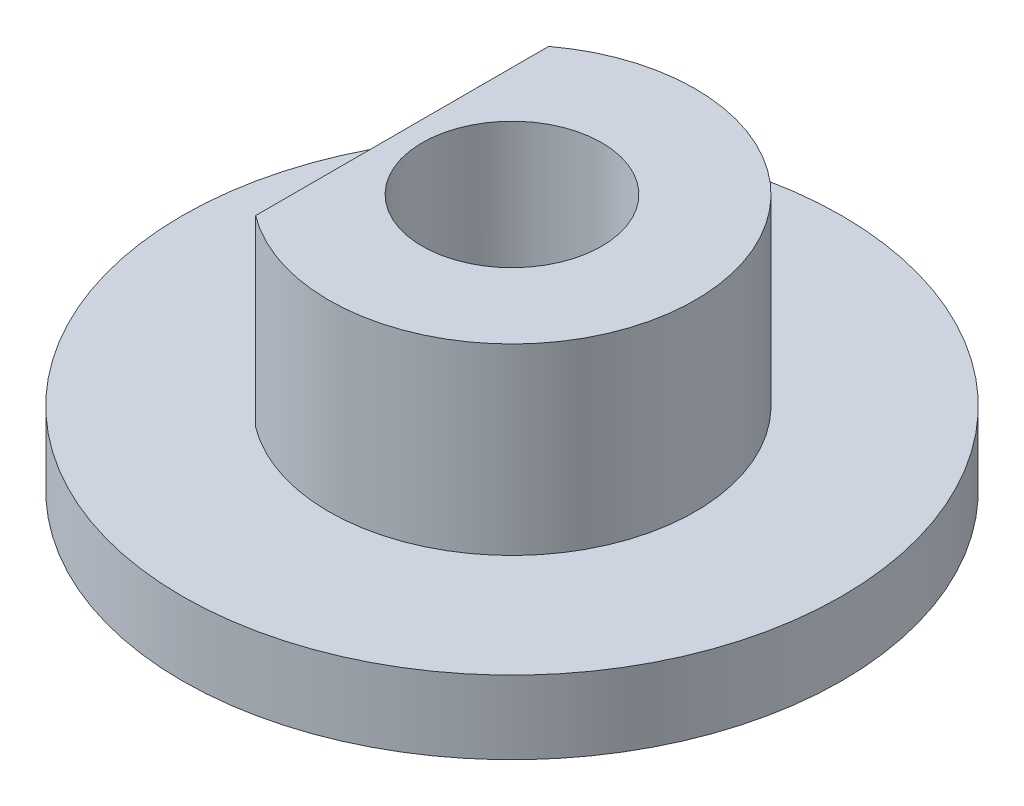
ISO-10303-21;
HEADER;
FILE_DESCRIPTION(('STEP AP214'),'2;1');
FILE_NAME('part.step','',(''),(''),'','','');
FILE_SCHEMA(('AUTOMOTIVE_DESIGN { 1 0 10303 214 1 1 1 1 }'));
ENDSEC;
DATA;
#1=APPLICATION_CONTEXT('core data for automotive mechanical design processes');
#2=APPLICATION_PROTOCOL_DEFINITION('international standard','automotive_design',2000,#1);
#3=PRODUCT_CONTEXT('',#1,'mechanical');
#4=PRODUCT('Part','Part','',(#3));
#5=PRODUCT_RELATED_PRODUCT_CATEGORY('part','',(#4));
#6=PRODUCT_DEFINITION_FORMATION('','',#4);
#7=PRODUCT_DEFINITION_CONTEXT('part definition',#1,'design');
#8=PRODUCT_DEFINITION('design','',#6,#7);
#9=PRODUCT_DEFINITION_SHAPE('','',#8);
#10=(LENGTH_UNIT() NAMED_UNIT(*) SI_UNIT(.MILLI.,.METRE.));
#11=(NAMED_UNIT(*) PLANE_ANGLE_UNIT() SI_UNIT($,.RADIAN.));
#12=(NAMED_UNIT(*) SI_UNIT($,.STERADIAN.) SOLID_ANGLE_UNIT());
#13=UNCERTAINTY_MEASURE_WITH_UNIT(LENGTH_MEASURE(1.E-05),#10,'distance_accuracy_value','');
#14=(GEOMETRIC_REPRESENTATION_CONTEXT(3) GLOBAL_UNCERTAINTY_ASSIGNED_CONTEXT((#13)) GLOBAL_UNIT_ASSIGNED_CONTEXT((#10,
#11,#12)) REPRESENTATION_CONTEXT('',''));
#15=CARTESIAN_POINT('',(0.,0.,0.));
#16=DIRECTION('',(0.,0.,1.));
#17=DIRECTION('',(1.,0.,0.));
#18=AXIS2_PLACEMENT_3D('',#15,#16,#17);
#19=CARTESIAN_POINT('',(0.,2.,0.));
#20=DIRECTION('',(0.,-1.,0.));
#21=DIRECTION('',(0.,0.,-1.));
#22=AXIS2_PLACEMENT_3D('',#19,#20,#21);
#23=CYLINDRICAL_SURFACE('',#22,9.);
#24=CARTESIAN_POINT('',(0.,2.,0.));
#25=DIRECTION('',(0.,1.,0.));
#26=DIRECTION('',(0.,0.,1.));
#27=AXIS2_PLACEMENT_3D('',#24,#25,#26);
#28=CIRCLE('',#27,9.);
#29=CARTESIAN_POINT('',(0.,2.,9.));
#30=VERTEX_POINT('',#29);
#31=EDGE_CURVE('E12',#30,#30,#28,.T.);
#32=ORIENTED_EDGE('',*,*,#31,.F.);
#33=EDGE_LOOP('',(#32));
#34=FACE_BOUND('',#33,.T.);
#35=CARTESIAN_POINT('',(0.,0.,0.));
#36=DIRECTION('',(0.,1.,0.));
#37=DIRECTION('',(0.,0.,1.));
#38=AXIS2_PLACEMENT_3D('',#35,#36,#37);
#39=CIRCLE('',#38,9.);
#40=CARTESIAN_POINT('',(0.,0.,9.));
#41=VERTEX_POINT('',#40);
#42=EDGE_CURVE('E69',#41,#41,#39,.T.);
#43=ORIENTED_EDGE('',*,*,#42,.T.);
#44=EDGE_LOOP('',(#43));
#45=FACE_BOUND('',#44,.T.);
#46=ADVANCED_FACE('F61',(#34,#45),#23,.T.);
#47=CARTESIAN_POINT('',(0.,0.,0.));
#48=DIRECTION('',(0.,1.,0.));
#49=DIRECTION('',(0.,0.,1.));
#50=AXIS2_PLACEMENT_3D('',#47,#48,#49);
#51=PLANE('',#50);
#52=CARTESIAN_POINT('',(0.,0.,0.));
#53=DIRECTION('',(0.,1.,0.));
#54=DIRECTION('',(0.,0.,1.));
#55=AXIS2_PLACEMENT_3D('',#52,#53,#54);
#56=CIRCLE('',#55,2.45);
#57=CARTESIAN_POINT('',(0.,0.,2.45));
#58=VERTEX_POINT('',#57);
#59=EDGE_CURVE('E75',#58,#58,#56,.T.);
#60=ORIENTED_EDGE('',*,*,#59,.T.);
#61=EDGE_LOOP('',(#60));
#62=FACE_BOUND('',#61,.T.);
#63=ORIENTED_EDGE('',*,*,#42,.F.);
#64=EDGE_LOOP('',(#63));
#65=FACE_BOUND('',#64,.T.);
#66=ADVANCED_FACE('F90',(#62,#65),#51,.F.);
#67=CARTESIAN_POINT('',(0.,2.,0.));
#68=DIRECTION('',(0.,1.,0.));
#69=DIRECTION('',(0.,0.,1.));
#70=AXIS2_PLACEMENT_3D('',#67,#68,#69);
#71=PLANE('',#70);
#72=CARTESIAN_POINT('',(0.,2.,0.));
#73=DIRECTION('',(0.,1.,0.));
#74=DIRECTION('',(0.,0.,1.));
#75=AXIS2_PLACEMENT_3D('',#72,#73,#74);
#76=CIRCLE('',#75,2.45);
#77=CARTESIAN_POINT('',(0.,2.,2.45));
#78=VERTEX_POINT('',#77);
#79=EDGE_CURVE('E64',#78,#78,#76,.T.);
#80=ORIENTED_EDGE('',*,*,#79,.F.);
#81=EDGE_LOOP('',(#80));
#82=FACE_BOUND('',#81,.T.);
#83=ORIENTED_EDGE('',*,*,#31,.T.);
#84=EDGE_LOOP('',(#83));
#85=FACE_BOUND('',#84,.T.);
#86=ADVANCED_FACE('F88',(#82,#85),#71,.T.);
#87=CARTESIAN_POINT('',(0.,7.,0.));
#88=DIRECTION('',(0.,-1.,0.));
#89=DIRECTION('',(0.,0.,-1.));
#90=AXIS2_PLACEMENT_3D('',#87,#88,#89);
#91=CYLINDRICAL_SURFACE('',#90,2.45);
#92=ORIENTED_EDGE('',*,*,#79,.T.);
#93=EDGE_LOOP('',(#92));
#94=FACE_BOUND('',#93,.T.);
#95=ORIENTED_EDGE('',*,*,#59,.F.);
#96=EDGE_LOOP('',(#95));
#97=FACE_BOUND('',#96,.T.);
#98=ADVANCED_FACE('F85',(#94,#97),#91,.F.);
#99=CLOSED_SHELL('',(#46,#66,#86,#98));
#100=MANIFOLD_SOLID_BREP('B2',#99);
#101=CARTESIAN_POINT('',(-3.,7.,0.));
#102=DIRECTION('',(1.,0.,0.));
#103=DIRECTION('',(0.,0.,-1.));
#104=AXIS2_PLACEMENT_3D('',#101,#102,#103);
#105=PLANE('',#104);
#106=DIRECTION('',(0.,0.,1.));
#107=VECTOR('',#106,1.);
#108=CARTESIAN_POINT('',(-3.,0.,0.));
#109=LINE('',#108,#107);
#110=CARTESIAN_POINT('',(-3.,0.,-4.));
#111=VERTEX_POINT('',#110);
#112=CARTESIAN_POINT('',(-3.,0.,4.));
#113=VERTEX_POINT('',#112);
#114=EDGE_CURVE('E173',#111,#113,#109,.T.);
#115=ORIENTED_EDGE('',*,*,#114,.T.);
#116=DIRECTION('',(0.,-1.,0.));
#117=VECTOR('',#116,1.);
#118=CARTESIAN_POINT('',(-3.,7.,4.));
#119=LINE('',#118,#117);
#120=CARTESIAN_POINT('',(-3.,7.,4.));
#121=VERTEX_POINT('',#120);
#122=EDGE_CURVE('E59',#121,#113,#119,.T.);
#123=ORIENTED_EDGE('',*,*,#122,.F.);
#124=DIRECTION('',(0.,0.,1.));
#125=VECTOR('',#124,1.);
#126=CARTESIAN_POINT('',(-3.,7.,0.));
#127=LINE('',#126,#125);
#128=CARTESIAN_POINT('',(-3.,7.,-4.));
#129=VERTEX_POINT('',#128);
#130=EDGE_CURVE('E172',#129,#121,#127,.T.);
#131=ORIENTED_EDGE('',*,*,#130,.F.);
#132=DIRECTION('',(0.,-1.,0.));
#133=VECTOR('',#132,1.);
#134=CARTESIAN_POINT('',(-3.,7.,-4.));
#135=LINE('',#134,#133);
#136=EDGE_CURVE('E150',#129,#111,#135,.T.);
#137=ORIENTED_EDGE('',*,*,#136,.T.);
#138=EDGE_LOOP('',(#115,#123,#131,#137));
#139=FACE_BOUND('',#138,.T.);
#140=ADVANCED_FACE('F141',(#139),#105,.F.);
#141=CARTESIAN_POINT('',(0.,7.,0.));
#142=DIRECTION('',(0.,-1.,0.));
#143=DIRECTION('',(0.,0.,-1.));
#144=AXIS2_PLACEMENT_3D('',#141,#142,#143);
#145=CYLINDRICAL_SURFACE('',#144,5.);
#146=CARTESIAN_POINT('',(0.,0.,0.));
#147=DIRECTION('',(0.,1.,0.));
#148=DIRECTION('',(0.,0.,1.));
#149=AXIS2_PLACEMENT_3D('',#146,#147,#148);
#150=CIRCLE('',#149,5.);
#151=EDGE_CURVE('E165',#113,#111,#150,.T.);
#152=ORIENTED_EDGE('',*,*,#151,.T.);
#153=ORIENTED_EDGE('',*,*,#136,.F.);
#154=CARTESIAN_POINT('',(0.,7.,0.));
#155=DIRECTION('',(0.,1.,0.));
#156=DIRECTION('',(0.,0.,1.));
#157=AXIS2_PLACEMENT_3D('',#154,#155,#156);
#158=CIRCLE('',#157,5.);
#159=EDGE_CURVE('E157',#121,#129,#158,.T.);
#160=ORIENTED_EDGE('',*,*,#159,.F.);
#161=ORIENTED_EDGE('',*,*,#122,.T.);
#162=EDGE_LOOP('',(#152,#153,#160,#161));
#163=FACE_BOUND('',#162,.T.);
#164=ADVANCED_FACE('F168',(#163),#145,.T.);
#165=CARTESIAN_POINT('',(0.,7.,0.));
#166=DIRECTION('',(0.,1.,0.));
#167=DIRECTION('',(0.,0.,1.));
#168=AXIS2_PLACEMENT_3D('',#165,#166,#167);
#169=PLANE('',#168);
#170=CARTESIAN_POINT('',(0.,7.,0.));
#171=DIRECTION('',(0.,-1.,0.));
#172=DIRECTION('',(0.,0.,-1.));
#173=AXIS2_PLACEMENT_3D('',#170,#171,#172);
#174=CIRCLE('',#173,2.45);
#175=CARTESIAN_POINT('',(0.,7.,-2.45));
#176=VERTEX_POINT('',#175);
#177=EDGE_CURVE('E180',#176,#176,#174,.T.);
#178=ORIENTED_EDGE('',*,*,#177,.T.);
#179=EDGE_LOOP('',(#178));
#180=FACE_BOUND('',#179,.T.);
#181=ORIENTED_EDGE('',*,*,#130,.T.);
#182=ORIENTED_EDGE('',*,*,#159,.T.);
#183=EDGE_LOOP('',(#181,#182));
#184=FACE_BOUND('',#183,.T.);
#185=ADVANCED_FACE('F187',(#180,#184),#169,.T.);
#186=CARTESIAN_POINT('',(0.,0.,0.));
#187=DIRECTION('',(0.,1.,0.));
#188=DIRECTION('',(0.,0.,1.));
#189=AXIS2_PLACEMENT_3D('',#186,#187,#188);
#190=PLANE('',#189);
#191=CARTESIAN_POINT('',(0.,0.,0.));
#192=DIRECTION('',(0.,1.,0.));
#193=DIRECTION('',(0.,0.,1.));
#194=AXIS2_PLACEMENT_3D('',#191,#192,#193);
#195=CIRCLE('',#194,2.45);
#196=CARTESIAN_POINT('',(0.,0.,2.45));
#197=VERTEX_POINT('',#196);
#198=EDGE_CURVE('E144',#197,#197,#195,.T.);
#199=ORIENTED_EDGE('',*,*,#198,.T.);
#200=EDGE_LOOP('',(#199));
#201=FACE_BOUND('',#200,.T.);
#202=ORIENTED_EDGE('',*,*,#114,.F.);
#203=ORIENTED_EDGE('',*,*,#151,.F.);
#204=EDGE_LOOP('',(#202,#203));
#205=FACE_BOUND('',#204,.T.);
#206=ADVANCED_FACE('F177',(#201,#205),#190,.F.);
#207=CARTESIAN_POINT('',(0.,7.,0.));
#208=DIRECTION('',(0.,-1.,0.));
#209=DIRECTION('',(0.,0.,-1.));
#210=AXIS2_PLACEMENT_3D('',#207,#208,#209);
#211=CYLINDRICAL_SURFACE('',#210,2.45);
#212=ORIENTED_EDGE('',*,*,#177,.F.);
#213=EDGE_LOOP('',(#212));
#214=FACE_BOUND('',#213,.T.);
#215=ORIENTED_EDGE('',*,*,#198,.F.);
#216=EDGE_LOOP('',(#215));
#217=FACE_BOUND('',#216,.T.);
#218=ADVANCED_FACE('F189',(#214,#217),#211,.F.);
#219=CLOSED_SHELL('',(#140,#164,#185,#206,#218));
#220=MANIFOLD_SOLID_BREP('B7',#219);
#221=ADVANCED_BREP_SHAPE_REPRESENTATION('',(#18,#100,#220),#14);
#222=SHAPE_DEFINITION_REPRESENTATION(#9,#221);
ENDSEC;
END-ISO-10303-21;
